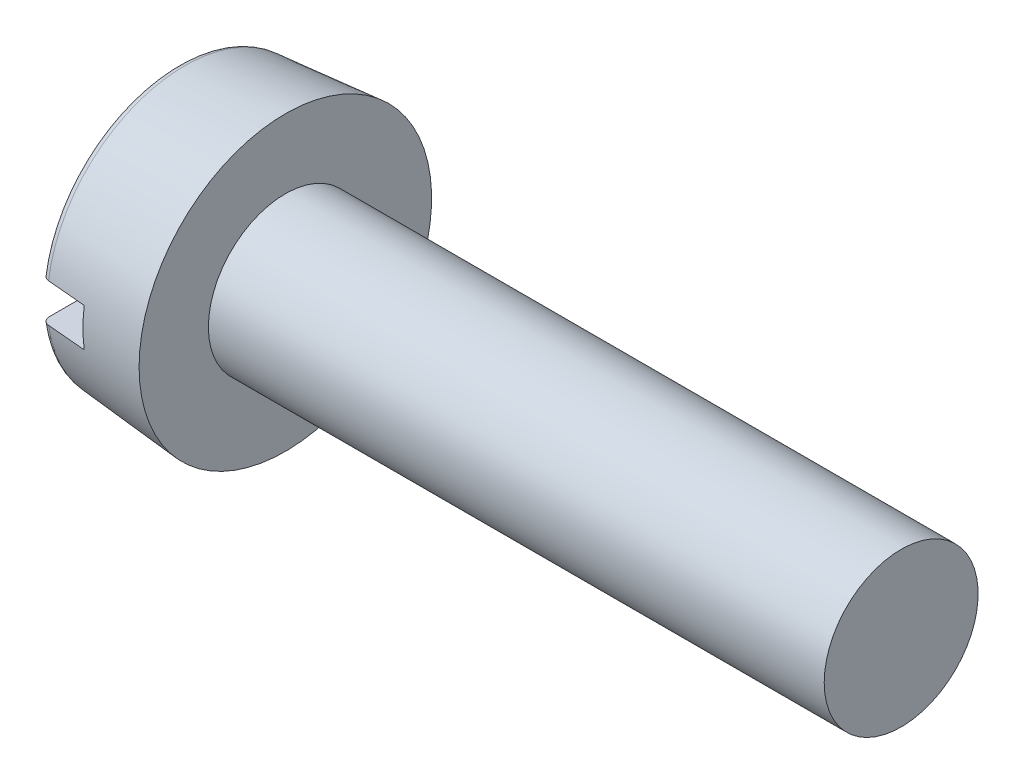
ISO-10303-21;
HEADER;
FILE_DESCRIPTION(('STEP AP214'),'2;1');
FILE_NAME('part.step','',(''),(''),'','','');
FILE_SCHEMA(('AUTOMOTIVE_DESIGN { 1 0 10303 214 1 1 1 1 }'));
ENDSEC;
DATA;
#1=APPLICATION_CONTEXT('core data for automotive mechanical design processes');
#2=APPLICATION_PROTOCOL_DEFINITION('international standard','automotive_design',2000,#1);
#3=PRODUCT_CONTEXT('',#1,'mechanical');
#4=PRODUCT('Part','Part','',(#3));
#5=PRODUCT_RELATED_PRODUCT_CATEGORY('part','',(#4));
#6=PRODUCT_DEFINITION_FORMATION('','',#4);
#7=PRODUCT_DEFINITION_CONTEXT('part definition',#1,'design');
#8=PRODUCT_DEFINITION('design','',#6,#7);
#9=PRODUCT_DEFINITION_SHAPE('','',#8);
#10=(LENGTH_UNIT() NAMED_UNIT(*) SI_UNIT(.MILLI.,.METRE.));
#11=(NAMED_UNIT(*) PLANE_ANGLE_UNIT() SI_UNIT($,.RADIAN.));
#12=(NAMED_UNIT(*) SI_UNIT($,.STERADIAN.) SOLID_ANGLE_UNIT());
#13=UNCERTAINTY_MEASURE_WITH_UNIT(LENGTH_MEASURE(1.E-05),#10,'distance_accuracy_value','');
#14=(GEOMETRIC_REPRESENTATION_CONTEXT(3) GLOBAL_UNCERTAINTY_ASSIGNED_CONTEXT((#13)) GLOBAL_UNIT_ASSIGNED_CONTEXT((#10,
#11,#12)) REPRESENTATION_CONTEXT('',''));
#15=CARTESIAN_POINT('',(0.,0.,0.));
#16=DIRECTION('',(0.,0.,1.));
#17=DIRECTION('',(1.,0.,0.));
#18=AXIS2_PLACEMENT_3D('',#15,#16,#17);
#19=CARTESIAN_POINT('',(0.,0.,0.));
#20=DIRECTION('',(-1.,0.,0.));
#21=DIRECTION('',(0.,0.,1.));
#22=AXIS2_PLACEMENT_3D('',#19,#20,#21);
#23=PLANE('',#22);
#24=DIRECTION('',(0.,0.,-1.));
#25=VECTOR('',#24,1.);
#26=CARTESIAN_POINT('',(0.,0.25,1.9));
#27=LINE('',#26,#25);
#28=CARTESIAN_POINT('',(0.,0.25,1.66724343126457));
#29=VERTEX_POINT('',#28);
#30=CARTESIAN_POINT('',(0.,0.25,-1.66724343126457));
#31=VERTEX_POINT('',#30);
#32=EDGE_CURVE('E103',#29,#31,#27,.T.);
#33=ORIENTED_EDGE('',*,*,#32,.F.);
#34=CARTESIAN_POINT('',(0.,0.,0.));
#35=DIRECTION('',(-1.,0.,0.));
#36=DIRECTION('',(0.,0.,1.));
#37=AXIS2_PLACEMENT_3D('',#34,#35,#36);
#38=CIRCLE('',#37,1.68588275366196);
#39=EDGE_CURVE('E105',#29,#31,#38,.T.);
#40=ORIENTED_EDGE('',*,*,#39,.T.);
#41=EDGE_LOOP('',(#33,#40));
#42=FACE_BOUND('',#41,.T.);
#43=ADVANCED_FACE('F35',(#42),#23,.T.);
#44=CARTESIAN_POINT('',(0.1,0.,0.));
#45=DIRECTION('',(-1.,0.,0.));
#46=DIRECTION('',(0.,0.,1.));
#47=AXIS2_PLACEMENT_3D('',#44,#45,#46);
#48=TOROIDAL_SURFACE('',#47,1.68588275366196,0.1);
#49=CARTESIAN_POINT('',(0.0301239837184526,0.25,-1.73954570987134));
#50=CARTESIAN_POINT('',(0.034112254025655,0.25,-1.74348114703534));
#51=CARTESIAN_POINT('',(0.0384332916495908,0.25,-1.74708479745269));
#52=CARTESIAN_POINT('',(0.047621596888568,0.25,-1.75351988324919));
#53=CARTESIAN_POINT('',(0.0524894518418904,0.25,-1.75635047687334));
#54=CARTESIAN_POINT('',(0.062632126905778,0.25,-1.7611518726827));
#55=CARTESIAN_POINT('',(0.0679068945512788,0.25,-1.76312278549305));
#56=CARTESIAN_POINT('',(0.0787122454713205,0.25,-1.76614517825523));
#57=CARTESIAN_POINT('',(0.0842427666888278,0.25,-1.76719688002821));
#58=CARTESIAN_POINT('',(0.095373394443947,0.25,-1.76834695503076));
#59=CARTESIAN_POINT('',(0.100972999637236,0.25,-1.76845018239128));
#60=CARTESIAN_POINT('',(0.112109811915657,0.25,-1.76771285537891));
#61=CARTESIAN_POINT('',(0.117647018058241,0.25,-1.76687228676909));
#62=CARTESIAN_POINT('',(0.128489803717952,0.25,-1.76427538353904));
#63=CARTESIAN_POINT('',(0.133795848010852,0.25,-1.76252098799906));
#64=CARTESIAN_POINT('',(0.144039730319539,0.25,-1.75814968615088));
#65=CARTESIAN_POINT('',(0.148977564711526,0.25,-1.75553277135543));
#66=CARTESIAN_POINT('',(0.15836674169469,0.25,-1.74950124280131));
#67=CARTESIAN_POINT('',(0.162816088565464,0.25,-1.74608352334629));
#68=CARTESIAN_POINT('',(0.171083921068067,0.25,-1.73855542384798));
#69=CARTESIAN_POINT('',(0.174902382724925,0.25,-1.73444501749311));
#70=CARTESIAN_POINT('',(0.181835504151915,0.25,-1.72561114445745));
#71=CARTESIAN_POINT('',(0.184943867145123,0.25,-1.72088273649891));
#72=CARTESIAN_POINT('',(0.190331805109598,0.25,-1.71097526726483));
#73=CARTESIAN_POINT('',(0.19261133485436,0.25,-1.7057961814165));
#74=CARTESIAN_POINT('',(0.196300503462131,0.25,-1.69507883946751));
#75=CARTESIAN_POINT('',(0.197701208750648,0.25,-1.68953750769915));
#76=CARTESIAN_POINT('',(0.199560107931746,0.25,-1.67829891478366));
#77=CARTESIAN_POINT('',(0.2000182569785,0.25,-1.67260164623029));
#78=CARTESIAN_POINT('',(0.199980488082452,0.25,-1.66116755240173));
#79=CARTESIAN_POINT('',(0.199477416691625,0.25,-1.65543074959807));
#80=CARTESIAN_POINT('',(0.197516883099685,0.25,-1.64412247089109));
#81=CARTESIAN_POINT('',(0.19605940106392,0.25,-1.6385509984262));
#82=CARTESIAN_POINT('',(0.192226434881595,0.25,-1.62772407078967));
#83=CARTESIAN_POINT('',(0.189849634285873,0.25,-1.62246908134511));
#84=CARTESIAN_POINT('',(0.184242507962168,0.25,-1.61243590232117));
#85=CARTESIAN_POINT('',(0.181012200803495,0.25,-1.60765770237164));
#86=CARTESIAN_POINT('',(0.173808398364609,0.25,-1.59874552852762));
#87=CARTESIAN_POINT('',(0.16983941365434,0.25,-1.5946079100141));
#88=CARTESIAN_POINT('',(0.161256212040593,0.25,-1.58706689346002));
#89=CARTESIAN_POINT('',(0.156642033668647,0.25,-1.58366345160461));
#90=CARTESIAN_POINT('',(0.146954193747203,0.25,-1.577728304209));
#91=CARTESIAN_POINT('',(0.141886222152689,0.25,-1.57518731173971));
#92=CARTESIAN_POINT('',(0.131392256265676,0.25,-1.57100326499133));
#93=CARTESIAN_POINT('',(0.125966286684049,0.25,-1.5693601488087));
#94=CARTESIAN_POINT('',(0.114975418023078,0.25,-1.56703614777695));
#95=CARTESIAN_POINT('',(0.109412743361664,0.25,-1.56634473553344));
#96=CARTESIAN_POINT('',(0.0982506296477884,0.25,-1.56591134324024));
#97=CARTESIAN_POINT('',(0.0926511921124149,0.25,-1.56616932425487));
#98=CARTESIAN_POINT('',(0.0816068018037831,0.25,-1.56762261837648));
#99=CARTESIAN_POINT('',(0.0761611699810637,0.25,-1.56881278083001));
#100=CARTESIAN_POINT('',(0.0655461187744446,0.25,-1.57208782392461));
#101=CARTESIAN_POINT('',(0.0603767005480557,0.25,-1.5741727083148));
#102=CARTESIAN_POINT('',(0.0504429211594084,0.25,-1.57918218125947));
#103=CARTESIAN_POINT('',(0.0456798188477843,0.25,-1.58210926476463));
#104=CARTESIAN_POINT('',(0.0367063855830663,0.25,-1.58871421123321));
#105=CARTESIAN_POINT('',(0.0324960808997952,0.25,-1.59239210985535));
#106=CARTESIAN_POINT('',(0.0247028499071559,0.25,-1.60043217731811));
#107=CARTESIAN_POINT('',(0.0211264966781283,0.25,-1.60480071638002));
#108=CARTESIAN_POINT('',(0.0147478039662305,0.25,-1.61407035663433));
#109=CARTESIAN_POINT('',(0.0119455146325412,0.25,-1.61897149230335));
#110=CARTESIAN_POINT('',(0.00716047536747477,0.25,-1.62922901712882));
#111=CARTESIAN_POINT('',(0.00518773010061175,0.25,-1.6345900743117));
#112=CARTESIAN_POINT('',(0.00216211004761502,0.25,-1.64556559292559));
#113=CARTESIAN_POINT('',(0.00110924708522794,0.25,-1.6511800576128));
#114=CARTESIAN_POINT('',(-5.33425649794324E-05,0.25,-1.66255157007252));
#115=CARTESIAN_POINT('',(-0.000155417619311267,0.25,-1.6683094013264));
#116=CARTESIAN_POINT('',(0.000607195995681169,0.25,-1.67976235656453));
#117=CARTESIAN_POINT('',(0.00147213868127235,0.25,-1.68545746367547));
#118=CARTESIAN_POINT('',(0.00414869895477062,0.25,-1.69663068032758));
#119=CARTESIAN_POINT('',(0.00596193608673396,0.25,-1.70210840133309));
#120=CARTESIAN_POINT('',(0.0104866705202582,0.25,-1.71267417663621));
#121=CARTESIAN_POINT('',(0.0131970742616454,0.25,-1.71776269608293));
#122=CARTESIAN_POINT('',(0.0183021368753953,0.25,-1.72564874312836));
#123=CARTESIAN_POINT('',(0.0204534266755831,0.25,-1.72860667972899));
#124=CARTESIAN_POINT('',(0.0250639712199923,0.25,-1.73427200964239));
#125=CARTESIAN_POINT('',(0.0275232249959105,0.25,-1.73697940374288));
#126=CARTESIAN_POINT('',(0.0301239837184526,0.25,-1.73954570987134));
#127=B_SPLINE_CURVE_WITH_KNOTS('',3,(#49,#50,#51,#52,#53,#54,#55,#56,#57,#58,#59,#60,#61,#62,
#63,#64,#65,#66,#67,#68,#69,#70,#71,#72,#73,#74,#75,#76,#77,#78,#79,#80,#81,#82,#83,#84,#85,#86,
#87,#88,#89,#90,#91,#92,#93,#94,#95,#96,#97,#98,#99,#100,#101,#102,#103,#104,#105,#106,#107,
#108,#109,#110,#111,#112,#113,#114,#115,#116,#117,#118,#119,#120,#121,#122,#123,#124,#125,#126),
.UNSPECIFIED.,.T.,.F.,(4,2,2,2,2,2,2,2,2,2,2,2,2,2,2,2,2,2,2,2,2,2,2,2,2,2,2,2,2,2,2,2,2,2,2,2,
2,2,4),(0.,0.0167959110445544,0.0336100383184083,0.0504220012837826,0.067229906117249,
0.0839517427346662,0.100673831600298,0.117360580985524,0.13404749457459,0.150800227323111,
0.16755359656452,0.184450209981753,0.201347745249247,0.21841437976708,0.235481826278521,
0.252676784421207,0.269872099922449,0.287092130544962,0.304311786550839,0.321429553193156,
0.338546297983667,0.355472401973108,0.372397338855157,0.389133511649821,0.405868998082989,
0.422512661437951,0.439156394534986,0.455849950224767,0.472544298931969,0.489402732254282,
0.506262257525773,0.523319657239104,0.540377276197228,0.557572051898691,0.574771345386106,
0.59200010906381,0.609207949388039,0.620160629655461,0.631113275486232),.UNSPECIFIED.);
#128=CARTESIAN_POINT('',(0.0912844257252333,0.25,-1.76791351316188));
#129=VERTEX_POINT('',#128);
#130=EDGE_CURVE('E59',#31,#129,#127,.T.);
#131=ORIENTED_EDGE('',*,*,#130,.F.);
#132=ORIENTED_EDGE('',*,*,#39,.F.);
#133=CARTESIAN_POINT('',(0.038410820052543,0.25,1.58753563015566));
#134=CARTESIAN_POINT('',(0.0427902939890951,0.25,1.58407005650774));
#135=CARTESIAN_POINT('',(0.0474630469549886,0.25,1.58096901798645));
#136=CARTESIAN_POINT('',(0.0572657439915521,0.25,1.57559125576911));
#137=CARTESIAN_POINT('',(0.0623961680717351,0.25,1.57331541051488));
#138=CARTESIAN_POINT('',(0.0729671844638347,0.25,1.56966008382672));
#139=CARTESIAN_POINT('',(0.07840774990333,0.25,1.56828052486143));
#140=CARTESIAN_POINT('',(0.0894424523036424,0.25,1.56646066317196));
#141=CARTESIAN_POINT('',(0.095036552043679,0.25,1.56602013480384));
#142=CARTESIAN_POINT('',(0.106187916851424,0.25,1.56609100566934));
#143=CARTESIAN_POINT('',(0.111745215600338,0.25,1.56659719462549));
#144=CARTESIAN_POINT('',(0.122695887603688,0.25,1.56853573821628));
#145=CARTESIAN_POINT('',(0.128089257112213,0.25,1.56996811399837));
#146=CARTESIAN_POINT('',(0.138558934280524,0.25,1.57371510963342));
#147=CARTESIAN_POINT('',(0.143635299693183,0.25,1.57602956823661));
#148=CARTESIAN_POINT('',(0.153331512379459,0.25,1.58147155156435));
#149=CARTESIAN_POINT('',(0.15795134553212,0.25,1.58459910142768));
#150=CARTESIAN_POINT('',(0.166642844689645,0.25,1.59160307133553));
#151=CARTESIAN_POINT('',(0.170709973240091,0.25,1.59548512047214));
#152=CARTESIAN_POINT('',(0.178144005385512,0.25,1.60386991016736));
#153=CARTESIAN_POINT('',(0.181510868111661,0.25,1.6083726869273));
#154=CARTESIAN_POINT('',(0.18749050008726,0.25,1.61792751523025));
#155=CARTESIAN_POINT('',(0.190093987175765,0.25,1.62298537603827));
#156=CARTESIAN_POINT('',(0.1944245750689,0.25,1.63346332336008));
#157=CARTESIAN_POINT('',(0.196151623655146,0.25,1.63888343143487));
#158=CARTESIAN_POINT('',(0.19869656706418,0.25,1.64999030292115));
#159=CARTESIAN_POINT('',(0.19950519348372,0.25,1.65567919157282));
#160=CARTESIAN_POINT('',(0.200160111365204,0.25,1.66711218979157));
#161=CARTESIAN_POINT('',(0.200006372625093,0.25,1.67285630108606));
#162=CARTESIAN_POINT('',(0.198737358913371,0.25,1.68426056047317));
#163=CARTESIAN_POINT('',(0.197618277112314,0.25,1.68992028578478));
#164=CARTESIAN_POINT('',(0.194442698747917,0.25,1.70097049473464));
#165=CARTESIAN_POINT('',(0.192386209487117,0.25,1.70636098046993));
#166=CARTESIAN_POINT('',(0.187399427297266,0.25,1.7166994325418));
#167=CARTESIAN_POINT('',(0.18447206309478,0.25,1.72164881093218));
#168=CARTESIAN_POINT('',(0.177821112560515,0.25,1.7309802162384));
#169=CARTESIAN_POINT('',(0.174097559800523,0.25,1.73536226706347));
#170=CARTESIAN_POINT('',(0.165993769608675,0.25,1.74339353418511));
#171=CARTESIAN_POINT('',(0.161619482864613,0.25,1.74704875411543));
#172=CARTESIAN_POINT('',(0.152314080979336,0.25,1.75356401214195));
#173=CARTESIAN_POINT('',(0.147382997277304,0.25,1.75642409510351));
#174=CARTESIAN_POINT('',(0.137157313470634,0.25,1.76123793804063));
#175=CARTESIAN_POINT('',(0.131866864335231,0.25,1.76320051691167));
#176=CARTESIAN_POINT('',(0.121030177928266,0.25,1.7662021188539));
#177=CARTESIAN_POINT('',(0.115483952770112,0.25,1.76724118561497));
#178=CARTESIAN_POINT('',(0.10433726421861,0.25,1.76836005573213));
#179=CARTESIAN_POINT('',(0.0987375081693258,0.25,1.76844691644335));
#180=CARTESIAN_POINT('',(0.087603319258539,0.25,1.76767711814466));
#181=CARTESIAN_POINT('',(0.0820688850795545,0.25,1.76682047819726));
#182=CARTESIAN_POINT('',(0.0712339359121825,0.25,1.76419215705386));
#183=CARTESIAN_POINT('',(0.0659329644744124,0.25,1.76242235604695));
#184=CARTESIAN_POINT('',(0.0557017028644443,0.25,1.75802135089928));
#185=CARTESIAN_POINT('',(0.0507714167878425,0.25,1.75539013724272));
#186=CARTESIAN_POINT('',(0.0413993898846341,0.25,1.74933132383135));
#187=CARTESIAN_POINT('',(0.0369596773547098,0.25,1.74590058763537));
#188=CARTESIAN_POINT('',(0.0287131089970532,0.25,1.73834824703872));
#189=CARTESIAN_POINT('',(0.0249062794513212,0.25,1.73422661396116));
#190=CARTESIAN_POINT('',(0.0179981143560025,0.25,1.72537218244404));
#191=CARTESIAN_POINT('',(0.0149031090922604,0.25,1.72063444579746));
#192=CARTESIAN_POINT('',(0.00954325096840232,0.25,1.71071066098417));
#193=CARTESIAN_POINT('',(0.00727844426054883,0.25,1.70552458791341));
#194=CARTESIAN_POINT('',(0.00361981721141317,0.25,1.6947956662052));
#195=CARTESIAN_POINT('',(0.00223495300327892,0.25,1.68924976295691));
#196=CARTESIAN_POINT('',(0.000408375366710347,0.25,1.67800493025775));
#197=CARTESIAN_POINT('',(-3.33291319020889E-05,0.25,1.67230599935852));
#198=CARTESIAN_POINT('',(3.75123327412075E-05,0.25,1.66087218591111));
#199=CARTESIAN_POINT('',(0.000557074784948298,0.25,1.65513734594055));
#200=CARTESIAN_POINT('',(0.00255033342308908,0.25,1.64383422369473));
#201=CARTESIAN_POINT('',(0.00402428246581622,0.25,1.63826598596849));
#202=CARTESIAN_POINT('',(0.0078899997087705,0.25,1.62744650084935));
#203=CARTESIAN_POINT('',(0.0102834602468332,0.25,1.62219585873013));
#204=CARTESIAN_POINT('',(0.0159217046243908,0.25,1.61217899485774));
#205=CARTESIAN_POINT('',(0.019165452268333,0.25,1.607412193218));
#206=CARTESIAN_POINT('',(0.0251008031700794,0.25,1.60011257766084));
#207=CARTESIAN_POINT('',(0.0275686339076144,0.25,1.59739475707804));
#208=CARTESIAN_POINT('',(0.0327857649139937,0.25,1.59224410808593));
#209=CARTESIAN_POINT('',(0.0355350642370449,0.25,1.58981127871903));
#210=CARTESIAN_POINT('',(0.038410820052543,0.25,1.58753563015566));
#211=B_SPLINE_CURVE_WITH_KNOTS('',3,(#133,#134,#135,#136,#137,#138,#139,#140,#141,#142,#143,
#144,#145,#146,#147,#148,#149,#150,#151,#152,#153,#154,#155,#156,#157,#158,#159,#160,#161,#162,
#163,#164,#165,#166,#167,#168,#169,#170,#171,#172,#173,#174,#175,#176,#177,#178,#179,#180,#181,
#182,#183,#184,#185,#186,#187,#188,#189,#190,#191,#192,#193,#194,#195,#196,#197,#198,#199,#200,
#201,#202,#203,#204,#205,#206,#207,#208,#209,#210),.UNSPECIFIED.,.T.,.F.,(4,2,2,2,2,2,2,2,2,2,2,
2,2,2,2,2,2,2,2,2,2,2,2,2,2,2,2,2,2,2,2,2,2,2,2,2,2,2,4),(0.,0.0167411910060397,
0.0335001515260866,0.0502576621545582,0.0670111455902061,0.0836726971117883,0.10033462907698,
0.116993516605719,0.133652919247718,0.150441746179846,0.167231552664634,0.184217767175992,
0.201204993610689,0.218362167205906,0.235519879250063,0.252745563649486,0.269971113860593,
0.287139377595869,0.304306917563326,0.321326154497721,0.338344430931905,0.355191689226128,
0.37203815046139,0.388759667571552,0.405480846845857,0.422167733967673,0.438854805431025,
0.455608474446361,0.472362839024728,0.489260888718256,0.50615987766299,0.523228221442542,
0.540296726824197,0.557490310608039,0.574688451553918,0.591918398070691,0.609127444285943,
0.620120485883896,0.631113490544151),.UNSPECIFIED.);
#212=CARTESIAN_POINT('',(0.0912844257209469,0.25,1.76791351317857));
#213=VERTEX_POINT('',#212);
#214=EDGE_CURVE('E95',#213,#29,#211,.T.);
#215=ORIENTED_EDGE('',*,*,#214,.F.);
#216=CARTESIAN_POINT('',(0.0912844257252333,0.,0.));
#217=DIRECTION('',(-1.,0.,0.));
#218=DIRECTION('',(0.,0.,1.));
#219=AXIS2_PLACEMENT_3D('',#216,#217,#218);
#220=CIRCLE('',#219,1.78550222347114);
#221=EDGE_CURVE('E109',#129,#213,#220,.F.);
#222=ORIENTED_EDGE('',*,*,#221,.F.);
#223=EDGE_LOOP('',(#131,#132,#215,#222));
#224=FACE_BOUND('',#223,.T.);
#225=ADVANCED_FACE('F186',(#224),#48,.T.);
#226=CARTESIAN_POINT('',(-25.4,0.,0.));
#227=DIRECTION('',(-1.,0.,0.));
#228=DIRECTION('',(0.,0.,1.));
#229=AXIS2_PLACEMENT_3D('',#226,#227,#228);
#230=CYLINDRICAL_SURFACE('',#229,1.);
#231=CARTESIAN_POINT('',(9.4,0.,0.));
#232=DIRECTION('',(-1.,0.,0.));
#233=DIRECTION('',(0.,0.,1.));
#234=AXIS2_PLACEMENT_3D('',#231,#232,#233);
#235=CIRCLE('',#234,1.);
#236=CARTESIAN_POINT('',(9.4,0.,1.));
#237=VERTEX_POINT('',#236);
#238=EDGE_CURVE('E106',#237,#237,#235,.T.);
#239=ORIENTED_EDGE('',*,*,#238,.T.);
#240=EDGE_LOOP('',(#239));
#241=FACE_BOUND('',#240,.T.);
#242=CARTESIAN_POINT('',(1.4,0.,0.));
#243=DIRECTION('',(-1.,0.,0.));
#244=DIRECTION('',(0.,0.,1.));
#245=AXIS2_PLACEMENT_3D('',#242,#243,#244);
#246=CIRCLE('',#245,1.);
#247=CARTESIAN_POINT('',(1.4,0.,1.));
#248=VERTEX_POINT('',#247);
#249=EDGE_CURVE('E173',#248,#248,#246,.T.);
#250=ORIENTED_EDGE('',*,*,#249,.F.);
#251=EDGE_LOOP('',(#250));
#252=FACE_BOUND('',#251,.T.);
#253=ADVANCED_FACE('F183',(#241,#252),#230,.T.);
#254=CARTESIAN_POINT('',(9.4,1.,0.));
#255=DIRECTION('',(1.,0.,0.));
#256=DIRECTION('',(0.,0.,-1.));
#257=AXIS2_PLACEMENT_3D('',#254,#255,#256);
#258=PLANE('',#257);
#259=ORIENTED_EDGE('',*,*,#238,.F.);
#260=EDGE_LOOP('',(#259));
#261=FACE_BOUND('',#260,.T.);
#262=ADVANCED_FACE('F185',(#261),#258,.T.);
#263=DIRECTION('',(0.,0.,1.));
#264=VECTOR('',#263,1.);
#265=CARTESIAN_POINT('',(0.,-0.25,-1.9));
#266=LINE('',#265,#264);
#267=CARTESIAN_POINT('',(0.,-0.25,-1.66724343126457));
#268=VERTEX_POINT('',#267);
#269=CARTESIAN_POINT('',(0.,-0.25,1.66724343126457));
#270=VERTEX_POINT('',#269);
#271=EDGE_CURVE('E51',#268,#270,#266,.T.);
#272=ORIENTED_EDGE('',*,*,#271,.F.);
#273=EDGE_CURVE('E101',#268,#270,#38,.T.);
#274=ORIENTED_EDGE('',*,*,#273,.T.);
#275=EDGE_LOOP('',(#272,#274));
#276=FACE_BOUND('',#275,.T.);
#277=ADVANCED_FACE('F100',(#276),#23,.T.);
#278=CARTESIAN_POINT('',(0.,0.,0.));
#279=DIRECTION('',(1.,0.,0.));
#280=DIRECTION('',(0.,0.,-1.));
#281=AXIS2_PLACEMENT_3D('',#278,#279,#280);
#282=CONICAL_SURFACE('',#281,1.77751587106371,0.0872664625997166);
#283=CARTESIAN_POINT('',(3.62107818810661,0.25,2.07934430853245));
#284=CARTESIAN_POINT('',(3.06980125604964,0.25,2.03076587392467));
#285=CARTESIAN_POINT('',(2.51852633750628,0.25,1.98216457470873));
#286=CARTESIAN_POINT('',(1.41598182372261,0.25,1.88490176224617));
#287=CARTESIAN_POINT('',(0.864712228482191,0.25,1.83624024900076));
#288=CARTESIAN_POINT('',(-0.237820369493236,0.25,1.7388425212793));
#289=CARTESIAN_POINT('',(-0.789083372228188,0.25,1.69010630680258));
#290=CARTESIAN_POINT('',(-1.89160065704932,0.25,1.59253521876818));
#291=CARTESIAN_POINT('',(-2.44285493913533,0.25,1.5437003452085));
#292=CARTESIAN_POINT('',(-2.99410378813087,0.25,1.49480416395094));
#293=B_SPLINE_CURVE_WITH_KNOTS('',3,(#283,#284,#285,#286,#287,#288,#289,#290,#291,#292),
.UNSPECIFIED.,.F.,.F.,(4,2,2,2,4),(0.,1.66023946632278,3.32047889930815,4.98071834715392,
6.64095782861457),.UNSPECIFIED.);
#294=CARTESIAN_POINT('',(0.6,0.25,1.8128522259904));
#295=VERTEX_POINT('',#294);
#296=EDGE_CURVE('E162',#295,#213,#293,.T.);
#297=ORIENTED_EDGE('',*,*,#296,.F.);
#298=CARTESIAN_POINT('',(0.6,0.,0.));
#299=DIRECTION('',(1.,0.,0.));
#300=DIRECTION('',(0.,0.,-1.));
#301=AXIS2_PLACEMENT_3D('',#298,#299,#300);
#302=CIRCLE('',#301,1.83000906917926);
#303=CARTESIAN_POINT('',(0.6,-0.25,1.8128522259904));
#304=VERTEX_POINT('',#303);
#305=EDGE_CURVE('E11',#304,#295,#302,.F.);
#306=ORIENTED_EDGE('',*,*,#305,.F.);
#307=CARTESIAN_POINT('',(-2.99410378813087,-0.25,1.49480416395094));
#308=CARTESIAN_POINT('',(-2.06836137178343,-0.25,1.57691372931172));
#309=CARTESIAN_POINT('',(-1.14260434025588,-0.25,1.65885820727604));
#310=CARTESIAN_POINT('',(-0.0400762748424807,-0.25,1.75630736694366));
#311=CARTESIAN_POINT('',(0.136684651711361,-0.25,1.77192637736924));
#312=CARTESIAN_POINT('',(1.41597857948217,-0.25,1.88493859856276));
#313=CARTESIAN_POINT('',(2.51852498766333,-0.25,1.98218009580805));
#314=CARTESIAN_POINT('',(3.62107818810661,-0.25,2.07934430853245));
#315=B_SPLINE_CURVE_WITH_KNOTS('',3,(#307,#308,#309,#310,#311,#312,#313,#314),.UNSPECIFIED.,.F.,
.F.,(4,2,2,4),(0.,2.78812996950874,3.32047892237668,6.64095781673274),.UNSPECIFIED.);
#316=CARTESIAN_POINT('',(0.0912844257252334,-0.25,1.76791351316188));
#317=VERTEX_POINT('',#316);
#318=EDGE_CURVE('E138',#317,#304,#315,.T.);
#319=ORIENTED_EDGE('',*,*,#318,.F.);
#320=CARTESIAN_POINT('',(0.091284425720508,-0.25,-1.76791351318017));
#321=VERTEX_POINT('',#320);
#322=EDGE_CURVE('E115',#317,#321,#220,.F.);
#323=ORIENTED_EDGE('',*,*,#322,.T.);
#324=CARTESIAN_POINT('',(3.62107818810661,-0.25,-2.07934430853245));
#325=CARTESIAN_POINT('',(3.06980125604964,-0.25,-2.03076587392467));
#326=CARTESIAN_POINT('',(2.51852633750628,-0.25,-1.98216457470873));
#327=CARTESIAN_POINT('',(1.41598182372261,-0.25,-1.88490176224617));
#328=CARTESIAN_POINT('',(0.864712228482191,-0.25,-1.83624024900076));
#329=CARTESIAN_POINT('',(-0.237820369493236,-0.25,-1.7388425212793));
#330=CARTESIAN_POINT('',(-0.789083372228188,-0.25,-1.69010630680258));
#331=CARTESIAN_POINT('',(-1.89160065704932,-0.25,-1.59253521876818));
#332=CARTESIAN_POINT('',(-2.44285493913533,-0.25,-1.5437003452085));
#333=CARTESIAN_POINT('',(-2.99410378813087,-0.25,-1.49480416395094));
#334=B_SPLINE_CURVE_WITH_KNOTS('',3,(#324,#325,#326,#327,#328,#329,#330,#331,#332,#333),
.UNSPECIFIED.,.F.,.F.,(4,2,2,2,4),(0.,1.66023946632278,3.32047889930815,4.98071834715392,
6.64095782861457),.UNSPECIFIED.);
#335=CARTESIAN_POINT('',(0.6,-0.25,-1.8128522259904));
#336=VERTEX_POINT('',#335);
#337=EDGE_CURVE('E90',#336,#321,#334,.T.);
#338=ORIENTED_EDGE('',*,*,#337,.F.);
#339=CARTESIAN_POINT('',(0.6,0.25,-1.8128522259904));
#340=VERTEX_POINT('',#339);
#341=EDGE_CURVE('E40',#340,#336,#302,.F.);
#342=ORIENTED_EDGE('',*,*,#341,.F.);
#343=CARTESIAN_POINT('',(-2.99410378813087,0.25,-1.49480416395094));
#344=CARTESIAN_POINT('',(-2.06836137178343,0.25,-1.57691372931172));
#345=CARTESIAN_POINT('',(-1.14260434025588,0.25,-1.65885820727604));
#346=CARTESIAN_POINT('',(-0.0400762748424807,0.25,-1.75630736694366));
#347=CARTESIAN_POINT('',(0.136684651711361,0.25,-1.77192637736924));
#348=CARTESIAN_POINT('',(1.41597857948217,0.25,-1.88493859856276));
#349=CARTESIAN_POINT('',(2.51852498766333,0.25,-1.98218009580805));
#350=CARTESIAN_POINT('',(3.62107818810661,0.25,-2.07934430853245));
#351=B_SPLINE_CURVE_WITH_KNOTS('',3,(#343,#344,#345,#346,#347,#348,#349,#350),.UNSPECIFIED.,.F.,
.F.,(4,2,2,4),(0.,2.78812996950874,3.32047892237668,6.64095781673274),.UNSPECIFIED.);
#352=EDGE_CURVE('E167',#129,#340,#351,.T.);
#353=ORIENTED_EDGE('',*,*,#352,.F.);
#354=ORIENTED_EDGE('',*,*,#221,.T.);
#355=EDGE_LOOP('',(#297,#306,#319,#323,#338,#342,#353,#354));
#356=FACE_BOUND('',#355,.T.);
#357=CARTESIAN_POINT('',(1.4,0.,0.));
#358=DIRECTION('',(-1.,0.,0.));
#359=DIRECTION('',(0.,0.,1.));
#360=AXIS2_PLACEMENT_3D('',#357,#358,#359);
#361=CIRCLE('',#360,1.9);
#362=CARTESIAN_POINT('',(1.4,0.,1.9));
#363=VERTEX_POINT('',#362);
#364=EDGE_CURVE('E111',#363,#363,#361,.T.);
#365=ORIENTED_EDGE('',*,*,#364,.T.);
#366=EDGE_LOOP('',(#365));
#367=FACE_BOUND('',#366,.T.);
#368=ADVANCED_FACE('F151',(#356,#367),#282,.T.);
#369=CARTESIAN_POINT('',(1.4,1.,0.));
#370=DIRECTION('',(-1.,0.,0.));
#371=DIRECTION('',(0.,0.,1.));
#372=AXIS2_PLACEMENT_3D('',#369,#370,#371);
#373=PLANE('',#372);
#374=ORIENTED_EDGE('',*,*,#364,.F.);
#375=EDGE_LOOP('',(#374));
#376=FACE_BOUND('',#375,.T.);
#377=ORIENTED_EDGE('',*,*,#249,.T.);
#378=EDGE_LOOP('',(#377));
#379=FACE_BOUND('',#378,.T.);
#380=ADVANCED_FACE('F155',(#376,#379),#373,.F.);
#381=CARTESIAN_POINT('',(0.0301239837184526,-0.25,-1.73954570987134));
#382=CARTESIAN_POINT('',(0.0260780259282709,-0.25,-1.7355526396478));
#383=CARTESIAN_POINT('',(0.0223687128122036,-0.25,-1.73121218004398));
#384=CARTESIAN_POINT('',(0.0157302639131425,-0.25,-1.72196511132148));
#385=CARTESIAN_POINT('',(0.0128021718532188,-0.25,-1.71705775723464));
#386=CARTESIAN_POINT('',(0.00781155963394486,-0.25,-1.70682606234138));
#387=CARTESIAN_POINT('',(0.00574827888609278,-0.25,-1.70150209285375));
#388=CARTESIAN_POINT('',(0.00253890332468147,-0.25,-1.69058637396543));
#389=CARTESIAN_POINT('',(0.00139257748788441,-0.25,-1.68499469239027));
#390=CARTESIAN_POINT('',(4.10282908944267E-05,-0.25,-1.6736612271434));
#391=CARTESIAN_POINT('',(-0.0001579375159541,-0.25,-1.66791869666335));
#392=CARTESIAN_POINT('',(0.000406868333239589,-0.25,-1.65648081813977));
#393=CARTESIAN_POINT('',(0.00117071281055949,-0.25,-1.6507854736979));
#394=CARTESIAN_POINT('',(0.00364543682274058,-0.25,-1.63958072861034));
#395=CARTESIAN_POINT('',(0.00536002222944712,-0.25,-1.63407214566351));
#396=CARTESIAN_POINT('',(0.00969258991345446,-0.25,-1.62342232819609));
#397=CARTESIAN_POINT('',(0.0123105654239295,-0.25,-1.61828109092426));
#398=CARTESIAN_POINT('',(0.018368687145406,-0.25,-1.60853152324288));
#399=CARTESIAN_POINT('',(0.021806099864217,-0.25,-1.60392149509216));
#400=CARTESIAN_POINT('',(0.0294130618130889,-0.25,-1.59535108561564));
#401=CARTESIAN_POINT('',(0.0335825743199985,-0.25,-1.59139067172354));
#402=CARTESIAN_POINT('',(0.0424928099447959,-0.25,-1.58427405023075));
#403=CARTESIAN_POINT('',(0.0472275909660962,-0.25,-1.58111040437777));
#404=CARTESIAN_POINT('',(0.0571661220583323,-0.25,-1.57563408783813));
#405=CARTESIAN_POINT('',(0.0623698398595655,-0.25,-1.57332135865154));
#406=CARTESIAN_POINT('',(0.0730321903589693,-0.25,-1.56964075335714));
#407=CARTESIAN_POINT('',(0.0784870693494757,-0.25,-1.5682620002125));
#408=CARTESIAN_POINT('',(0.0895514615468668,-0.25,-1.56644822093411));
#409=CARTESIAN_POINT('',(0.0951609661760001,-0.25,-1.56601314255693));
#410=CARTESIAN_POINT('',(0.106327002489757,-0.25,-1.56609980469677));
#411=CARTESIAN_POINT('',(0.111883595726444,-0.25,-1.56661383635248));
#412=CARTESIAN_POINT('',(0.122831388816505,-0.25,-1.56856777941325));
#413=CARTESIAN_POINT('',(0.128222590680128,-0.25,-1.57000767956016));
#414=CARTESIAN_POINT('',(0.138686958017419,-0.25,-1.57376928649222));
#415=CARTESIAN_POINT('',(0.143760167134578,-0.25,-1.57609087195876));
#416=CARTESIAN_POINT('',(0.153448951544549,-0.25,-1.58154646534634));
#417=CARTESIAN_POINT('',(0.158064511721778,-0.25,-1.58468050008924));
#418=CARTESIAN_POINT('',(0.166746542197497,-0.25,-1.59169675607619));
#419=CARTESIAN_POINT('',(0.170808452559137,-0.25,-1.59558461824979));
#420=CARTESIAN_POINT('',(0.178231167530174,-0.25,-1.60398009132926));
#421=CARTESIAN_POINT('',(0.181591930079707,-0.25,-1.60848773938744));
#422=CARTESIAN_POINT('',(0.187558577382552,-0.25,-1.61805131058344));
#423=CARTESIAN_POINT('',(0.190155167963793,-0.25,-1.62311303257518));
#424=CARTESIAN_POINT('',(0.194471398021903,-0.25,-1.63359750325318));
#425=CARTESIAN_POINT('',(0.196190986225804,-0.25,-1.63902027302674));
#426=CARTESIAN_POINT('',(0.198720541525037,-0.25,-1.6501311220685));
#427=CARTESIAN_POINT('',(0.199521253042963,-0.25,-1.65582131006132));
#428=CARTESIAN_POINT('',(0.200160205109374,-0.25,-1.66725556951255));
#429=CARTESIAN_POINT('',(0.199998414852101,-0.25,-1.67299964268973));
#430=CARTESIAN_POINT('',(0.198713360352002,-0.25,-1.68440229675822));
#431=CARTESIAN_POINT('',(0.197586318442357,-0.25,-1.6900604527342));
#432=CARTESIAN_POINT('',(0.194395171653612,-0.25,-1.70110618713494));
#433=CARTESIAN_POINT('',(0.192331075364088,-0.25,-1.70649376803945));
#434=CARTESIAN_POINT('',(0.187329743049282,-0.25,-1.71682501034087));
#435=CARTESIAN_POINT('',(0.184395458897692,-0.25,-1.7217701001031));
#436=CARTESIAN_POINT('',(0.177731477244738,-0.25,-1.73109181693493));
#437=CARTESIAN_POINT('',(0.174001811840985,-0.25,-1.73546846693245));
#438=CARTESIAN_POINT('',(0.16588691119851,-0.25,-1.74348794106844));
#439=CARTESIAN_POINT('',(0.161507629441039,-0.25,-1.74713678874591));
#440=CARTESIAN_POINT('',(0.152193383444686,-0.25,-1.75363855606621));
#441=CARTESIAN_POINT('',(0.147258449475751,-0.25,-1.75649151903657));
#442=CARTESIAN_POINT('',(0.137026259848382,-0.25,-1.76129070832175));
#443=CARTESIAN_POINT('',(0.131733133431451,-0.25,-1.76324573979348));
#444=CARTESIAN_POINT('',(0.120892616958677,-0.25,-1.76623183391573));
#445=CARTESIAN_POINT('',(0.11534524913605,-0.25,-1.76726297719811));
#446=CARTESIAN_POINT('',(0.104198164295004,-0.25,-1.76836600998605));
#447=CARTESIAN_POINT('',(0.0985991525060395,-0.25,-1.76844503986814));
#448=CARTESIAN_POINT('',(0.0874662076269176,-0.25,-1.76765975687259));
#449=CARTESIAN_POINT('',(0.0819322899786183,-0.25,-1.76679522454642));
#450=CARTESIAN_POINT('',(0.0710974014185309,-0.25,-1.76415096656149));
#451=CARTESIAN_POINT('',(0.0657960842145958,-0.25,-1.76237265523513));
#452=CARTESIAN_POINT('',(0.0555703957728278,-0.25,-1.75795545669432));
#453=CARTESIAN_POINT('',(0.0506455770568968,-0.25,-1.75531761132611));
#454=CARTESIAN_POINT('',(0.0431273776562807,-0.25,-1.75044285417604));
#455=CARTESIAN_POINT('',(0.040372795188405,-0.25,-1.74844968976037));
#456=CARTESIAN_POINT('',(0.0350800601103007,-0.25,-1.74419427547474));
#457=CARTESIAN_POINT('',(0.0325419067549643,-0.25,-1.74193202653123));
#458=CARTESIAN_POINT('',(0.0301239837184526,-0.25,-1.73954570987134));
#459=B_SPLINE_CURVE_WITH_KNOTS('',3,(#381,#382,#383,#384,#385,#386,#387,#388,#389,#390,#391,
#392,#393,#394,#395,#396,#397,#398,#399,#400,#401,#402,#403,#404,#405,#406,#407,#408,#409,#410,
#411,#412,#413,#414,#415,#416,#417,#418,#419,#420,#421,#422,#423,#424,#425,#426,#427,#428,#429,
#430,#431,#432,#433,#434,#435,#436,#437,#438,#439,#440,#441,#442,#443,#444,#445,#446,#447,#448,
#449,#450,#451,#452,#453,#454,#455,#456,#457,#458),.UNSPECIFIED.,.T.,.F.,(4,2,2,2,2,2,2,2,2,2,2,
2,2,2,2,2,2,2,2,2,2,2,2,2,2,2,2,2,2,2,2,2,2,2,2,2,2,2,4),(0.,0.0170411722438939,
0.0341049990186796,0.0511537867645733,0.0681982777803319,0.0853551972527309,0.102513414450954,
0.119738987255988,0.136964431036009,0.154133198727651,0.17130110545575,0.188302245400992,
0.205302216311466,0.222100636581184,0.238898126838039,0.25555978426519,0.272221239097884,
0.288880402169165,0.305540115289019,0.322329672912014,0.339120237403425,0.356107292735505,
0.373095341083041,0.390253043299335,0.407411294666675,0.424637006068489,0.441862559572752,
0.459030335786743,0.476197419326211,0.493215918450514,0.510233490915956,0.527080425228571,
0.543925889090265,0.560644941023429,0.577367882210948,0.594065017517698,0.610741988948958,
0.620926075619136,0.631110127226808),.UNSPECIFIED.);
#460=EDGE_CURVE('E86',#321,#268,#459,.T.);
#461=ORIENTED_EDGE('',*,*,#460,.F.);
#462=ORIENTED_EDGE('',*,*,#322,.F.);
#463=CARTESIAN_POINT('',(0.0384108200525428,-0.25,1.58753563015566));
#464=CARTESIAN_POINT('',(0.0339573950704059,-0.25,1.5910603658954));
#465=CARTESIAN_POINT('',(0.029800799942917,-0.25,1.59496730933873));
#466=CARTESIAN_POINT('',(0.0222010182064333,-0.25,1.60342863634491));
#467=CARTESIAN_POINT('',(0.0187588035663528,-0.25,1.60798388796708));
#468=CARTESIAN_POINT('',(0.0126884755380015,-0.25,1.61760223594505));
#469=CARTESIAN_POINT('',(0.0100595998475481,-0.25,1.62266485084517));
#470=CARTESIAN_POINT('',(0.00568272388268354,-0.25,1.63315559353335));
#471=CARTESIAN_POINT('',(0.0039344989316743,-0.25,1.63858362769256));
#472=CARTESIAN_POINT('',(0.00135420896618537,-0.25,1.6496959787203));
#473=CARTESIAN_POINT('',(0.000529062493142384,-0.25,1.65538190290297));
#474=CARTESIAN_POINT('',(-0.000159268616023203,-0.25,1.66681204026049));
#475=CARTESIAN_POINT('',(-2.23806129213034E-05,-0.25,1.67255625780414));
#476=CARTESIAN_POINT('',(0.00121306917338677,-0.25,1.68396387537009));
#477=CARTESIAN_POINT('',(0.0023154907130275,-0.25,1.68962685820058));
#478=CARTESIAN_POINT('',(0.00545847496257983,-0.25,1.70068635267493));
#479=CARTESIAN_POINT('',(0.00749902870568369,-0.25,1.70608286686519));
#480=CARTESIAN_POINT('',(0.0124553209196926,-0.25,1.71643631844882));
#481=CARTESIAN_POINT('',(0.0153681805259015,-0.25,1.72139463336573));
#482=CARTESIAN_POINT('',(0.0219918139097583,-0.25,1.73074625136145));
#483=CARTESIAN_POINT('',(0.0257025525730674,-0.25,1.73513957929153));
#484=CARTESIAN_POINT('',(0.0337830293566341,-0.25,1.7431954661646));
#485=CARTESIAN_POINT('',(0.0381468204499068,-0.25,1.74686398949027));
#486=CARTESIAN_POINT('',(0.0474336489372385,-0.25,1.7534074422751));
#487=CARTESIAN_POINT('',(0.0523566554179295,-0.25,1.75628241557152));
#488=CARTESIAN_POINT('',(0.062568882579993,-0.25,1.76112700539213));
#489=CARTESIAN_POINT('',(0.0678539229214086,-0.25,1.76310543520284));
#490=CARTESIAN_POINT('',(0.0786825580230994,-0.25,1.76613938813517));
#491=CARTESIAN_POINT('',(0.0842261404099094,-0.25,1.76719495537608));
#492=CARTESIAN_POINT('',(0.0953701815790082,-0.25,1.76834682813952));
#493=CARTESIAN_POINT('',(0.100969908426044,-0.25,1.76845022511559));
#494=CARTESIAN_POINT('',(0.112106813064689,-0.25,1.76771321576232));
#495=CARTESIAN_POINT('',(0.117643992150452,-0.25,1.76687282899673));
#496=CARTESIAN_POINT('',(0.128486801349998,-0.25,1.76427628463559));
#497=CARTESIAN_POINT('',(0.133792894145407,-0.25,1.76252205760683));
#498=CARTESIAN_POINT('',(0.144036912707969,-0.25,1.75815107926835));
#499=CARTESIAN_POINT('',(0.148974834149097,-0.25,1.75553431782577));
#500=CARTESIAN_POINT('',(0.15836419767094,-0.25,1.74950308538222));
#501=CARTESIAN_POINT('',(0.162813645288571,-0.25,1.74608551042966));
#502=CARTESIAN_POINT('',(0.171081709116823,-0.25,1.73855767538295));
#503=CARTESIAN_POINT('',(0.174900300331172,-0.25,1.73444738785466));
#504=CARTESIAN_POINT('',(0.18183369697909,-0.25,1.72561373225442));
#505=CARTESIAN_POINT('',(0.184942206210862,-0.25,1.72088542303857));
#506=CARTESIAN_POINT('',(0.190330447701009,-0.25,1.7109781307854));
#507=CARTESIAN_POINT('',(0.192610135624697,-0.25,1.70579912365806));
#508=CARTESIAN_POINT('',(0.19629963411489,-0.25,1.69508191169097));
#509=CARTESIAN_POINT('',(0.197700511048479,-0.25,1.68954063085116));
#510=CARTESIAN_POINT('',(0.199559761114849,-0.25,1.67830210616433));
#511=CARTESIAN_POINT('',(0.200018088664459,-0.25,1.67260485478783));
#512=CARTESIAN_POINT('',(0.19998067881951,-0.25,1.66117076172758));
#513=CARTESIAN_POINT('',(0.199477787367227,-0.25,1.65543394229265));
#514=CARTESIAN_POINT('',(0.197517609613423,-0.25,1.64412560727951));
#515=CARTESIAN_POINT('',(0.19606030463383,-0.25,1.63855409493864));
#516=CARTESIAN_POINT('',(0.192227684515839,-0.25,1.62772705594972));
#517=CARTESIAN_POINT('',(0.189851052632653,-0.25,1.62247199508646));
#518=CARTESIAN_POINT('',(0.184244245083918,-0.25,1.6124386350999));
#519=CARTESIAN_POINT('',(0.181014086328863,-0.25,1.60766032653354));
#520=CARTESIAN_POINT('',(0.173810564074661,-0.25,1.59874791823183));
#521=CARTESIAN_POINT('',(0.169841712242575,-0.25,1.59461017322819));
#522=CARTESIAN_POINT('',(0.161258744744242,-0.25,1.58706887510163));
#523=CARTESIAN_POINT('',(0.156644666353808,-0.25,1.58366527959454));
#524=CARTESIAN_POINT('',(0.146956906135104,-0.25,1.57772975331653));
#525=CARTESIAN_POINT('',(0.141888904809587,-0.25,1.57518855169054));
#526=CARTESIAN_POINT('',(0.131395039843866,-0.25,1.57100420461337));
#527=CARTESIAN_POINT('',(0.125969215308606,-0.25,1.5693609612099));
#528=CARTESIAN_POINT('',(0.114979237434394,-0.25,1.56703676449653));
#529=CARTESIAN_POINT('',(0.109417329315998,-0.25,1.56634518516968));
#530=CARTESIAN_POINT('',(0.0982551532904772,-0.25,1.56591124754994));
#531=CARTESIAN_POINT('',(0.0926548774749354,-0.25,1.56616909121188));
#532=CARTESIAN_POINT('',(0.081606644355173,-0.25,1.56762238853903));
#533=CARTESIAN_POINT('',(0.0761580649375367,-0.25,1.5688131425548));
#534=CARTESIAN_POINT('',(0.0655421563582805,-0.25,1.57208964252859));
#535=CARTESIAN_POINT('',(0.0603744926639948,-0.25,1.57417429644248));
#536=CARTESIAN_POINT('',(0.0524104046253594,-0.25,1.57818971720466));
#537=CARTESIAN_POINT('',(0.0494794583378909,-0.25,1.57985966161506));
#538=CARTESIAN_POINT('',(0.0438011029424251,-0.25,1.583486746576));
#539=CARTESIAN_POINT('',(0.0410536927850414,-0.25,1.58544388548427));
#540=CARTESIAN_POINT('',(0.0384108200525428,-0.25,1.58753563015566));
#541=B_SPLINE_CURVE_WITH_KNOTS('',3,(#463,#464,#465,#466,#467,#468,#469,#470,#471,#472,#473,
#474,#475,#476,#477,#478,#479,#480,#481,#482,#483,#484,#485,#486,#487,#488,#489,#490,#491,#492,
#493,#494,#495,#496,#497,#498,#499,#500,#501,#502,#503,#504,#505,#506,#507,#508,#509,#510,#511,
#512,#513,#514,#515,#516,#517,#518,#519,#520,#521,#522,#523,#524,#525,#526,#527,#528,#529,#530,
#531,#532,#533,#534,#535,#536,#537,#538,#539,#540),.UNSPECIFIED.,.T.,.F.,(4,2,2,2,2,2,2,2,2,2,2,
2,2,2,2,2,2,2,2,2,2,2,2,2,2,2,2,2,2,2,2,2,2,2,2,2,2,2,4),(0.,0.0170260326836833,
0.0340750808686447,0.0511081010790944,0.0681367735254192,0.0852922394400297,0.102449000706479,
0.119674661423913,0.136900157499331,0.154069419429614,0.171237925902129,0.188258660059426,
0.2052784537698,0.2221271015527,0.238974943808383,0.255697206422081,0.272419122405356,
0.289105854300129,0.305792782233615,0.322545490967143,0.33929886333009,0.356195470160691,
0.373092980678955,0.390159593483887,0.407227031637652,0.424421992283971,0.441617289449299,
0.458837307047765,0.476056983500326,0.493174748345185,0.510291524676525,0.527217987985618,
0.544142604530748,0.560876668671793,0.577614292575123,0.594268136617214,0.610901692986447,
0.621005802745754,0.631109854728851),.UNSPECIFIED.);
#542=EDGE_CURVE('E96',#270,#317,#541,.T.);
#543=ORIENTED_EDGE('',*,*,#542,.F.);
#544=ORIENTED_EDGE('',*,*,#273,.F.);
#545=EDGE_LOOP('',(#461,#462,#543,#544));
#546=FACE_BOUND('',#545,.T.);
#547=ADVANCED_FACE('F37',(#546),#48,.T.);
#548=CARTESIAN_POINT('',(0.6,0.25,1.9));
#549=DIRECTION('',(0.,1.,0.));
#550=DIRECTION('',(0.,0.,1.));
#551=AXIS2_PLACEMENT_3D('',#548,#549,#550);
#552=PLANE('',#551);
#553=ORIENTED_EDGE('',*,*,#352,.T.);
#554=DIRECTION('',(0.,0.,-1.));
#555=VECTOR('',#554,1.);
#556=CARTESIAN_POINT('',(0.6,0.25,1.9));
#557=LINE('',#556,#555);
#558=EDGE_CURVE('E102',#295,#340,#557,.T.);
#559=ORIENTED_EDGE('',*,*,#558,.F.);
#560=ORIENTED_EDGE('',*,*,#296,.T.);
#561=ORIENTED_EDGE('',*,*,#214,.T.);
#562=ORIENTED_EDGE('',*,*,#32,.T.);
#563=ORIENTED_EDGE('',*,*,#130,.T.);
#564=EDGE_LOOP('',(#553,#559,#560,#561,#562,#563));
#565=FACE_BOUND('',#564,.T.);
#566=ADVANCED_FACE('F130',(#565),#552,.F.);
#567=CARTESIAN_POINT('',(0.6,-0.25,-1.9));
#568=DIRECTION('',(0.,-1.,0.));
#569=DIRECTION('',(0.,0.,-1.));
#570=AXIS2_PLACEMENT_3D('',#567,#568,#569);
#571=PLANE('',#570);
#572=ORIENTED_EDGE('',*,*,#337,.T.);
#573=ORIENTED_EDGE('',*,*,#460,.T.);
#574=ORIENTED_EDGE('',*,*,#271,.T.);
#575=ORIENTED_EDGE('',*,*,#542,.T.);
#576=ORIENTED_EDGE('',*,*,#318,.T.);
#577=DIRECTION('',(0.,0.,1.));
#578=VECTOR('',#577,1.);
#579=CARTESIAN_POINT('',(0.6,-0.25,-1.9));
#580=LINE('',#579,#578);
#581=EDGE_CURVE('E144',#336,#304,#580,.T.);
#582=ORIENTED_EDGE('',*,*,#581,.F.);
#583=EDGE_LOOP('',(#572,#573,#574,#575,#576,#582));
#584=FACE_BOUND('',#583,.T.);
#585=ADVANCED_FACE('F87',(#584),#571,.F.);
#586=CARTESIAN_POINT('',(0.6,-0.25,-1.9));
#587=DIRECTION('',(1.,0.,0.));
#588=DIRECTION('',(0.,0.,-1.));
#589=AXIS2_PLACEMENT_3D('',#586,#587,#588);
#590=PLANE('',#589);
#591=ORIENTED_EDGE('',*,*,#305,.T.);
#592=ORIENTED_EDGE('',*,*,#558,.T.);
#593=ORIENTED_EDGE('',*,*,#341,.T.);
#594=ORIENTED_EDGE('',*,*,#581,.T.);
#595=EDGE_LOOP('',(#591,#592,#593,#594));
#596=FACE_BOUND('',#595,.T.);
#597=ADVANCED_FACE('F129',(#596),#590,.F.);
#598=CLOSED_SHELL('',(#43,#225,#253,#262,#277,#368,#380,#547,#566,#585,#597));
#599=MANIFOLD_SOLID_BREP('B2',#598);
#600=ADVANCED_BREP_SHAPE_REPRESENTATION('',(#18,#599),#14);
#601=SHAPE_DEFINITION_REPRESENTATION(#9,#600);
ENDSEC;
END-ISO-10303-21;
